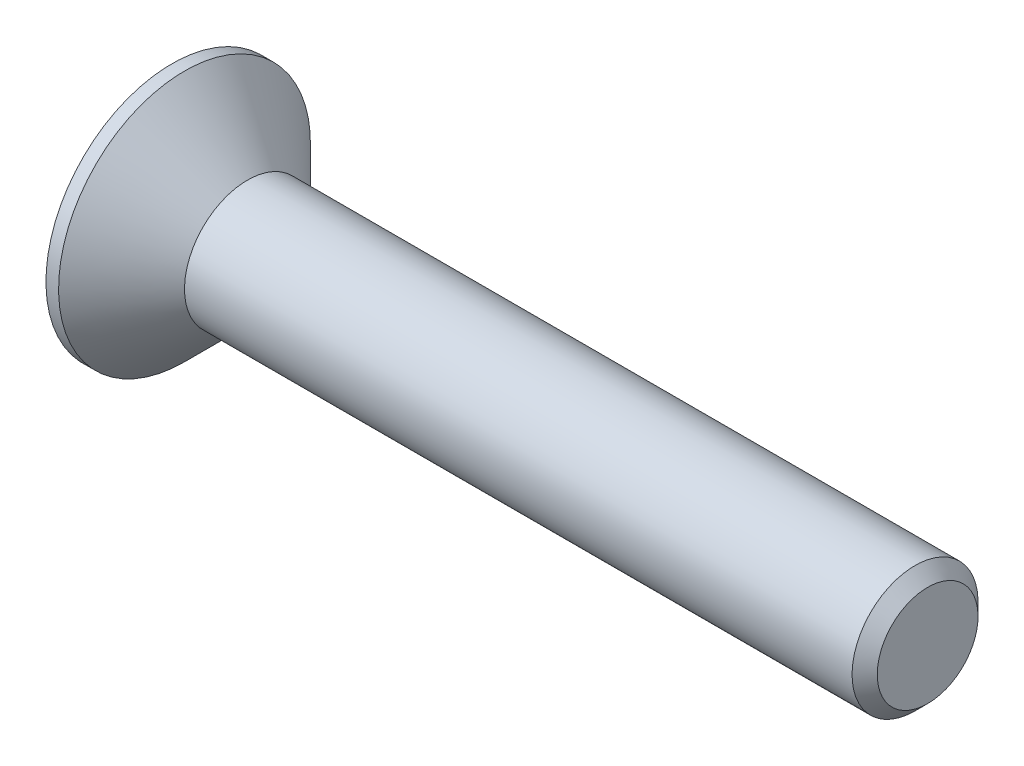
ISO-10303-21;
HEADER;
FILE_DESCRIPTION(('STEP AP214'),'2;1');
FILE_NAME('part.step','',(''),(''),'','','');
FILE_SCHEMA(('AUTOMOTIVE_DESIGN { 1 0 10303 214 1 1 1 1 }'));
ENDSEC;
DATA;
#1=APPLICATION_CONTEXT('core data for automotive mechanical design processes');
#2=APPLICATION_PROTOCOL_DEFINITION('international standard','automotive_design',2000,#1);
#3=PRODUCT_CONTEXT('',#1,'mechanical');
#4=PRODUCT('Part','Part','',(#3));
#5=PRODUCT_RELATED_PRODUCT_CATEGORY('part','',(#4));
#6=PRODUCT_DEFINITION_FORMATION('','',#4);
#7=PRODUCT_DEFINITION_CONTEXT('part definition',#1,'design');
#8=PRODUCT_DEFINITION('design','',#6,#7);
#9=PRODUCT_DEFINITION_SHAPE('','',#8);
#10=(LENGTH_UNIT() NAMED_UNIT(*) SI_UNIT(.MILLI.,.METRE.));
#11=(NAMED_UNIT(*) PLANE_ANGLE_UNIT() SI_UNIT($,.RADIAN.));
#12=(NAMED_UNIT(*) SI_UNIT($,.STERADIAN.) SOLID_ANGLE_UNIT());
#13=UNCERTAINTY_MEASURE_WITH_UNIT(LENGTH_MEASURE(1.E-05),#10,'distance_accuracy_value','');
#14=(GEOMETRIC_REPRESENTATION_CONTEXT(3) GLOBAL_UNCERTAINTY_ASSIGNED_CONTEXT((#13)) GLOBAL_UNIT_ASSIGNED_CONTEXT((#10,
#11,#12)) REPRESENTATION_CONTEXT('',''));
#15=CARTESIAN_POINT('',(0.,0.,0.));
#16=DIRECTION('',(0.,0.,1.));
#17=DIRECTION('',(1.,0.,0.));
#18=AXIS2_PLACEMENT_3D('',#15,#16,#17);
#19=CARTESIAN_POINT('',(-1.2,0.,0.));
#20=DIRECTION('',(-1.,0.,0.));
#21=DIRECTION('',(0.,-1.,0.));
#22=AXIS2_PLACEMENT_3D('',#19,#20,#21);
#23=CYLINDRICAL_SURFACE('',#22,1.);
#24=CARTESIAN_POINT('',(10.6,0.,0.));
#25=DIRECTION('',(-1.,0.,0.));
#26=DIRECTION('',(0.,-1.,0.));
#27=AXIS2_PLACEMENT_3D('',#24,#25,#26);
#28=CIRCLE('',#27,1.);
#29=CARTESIAN_POINT('',(10.6,-1.,0.));
#30=VERTEX_POINT('',#29);
#31=EDGE_CURVE('E41',#30,#30,#28,.T.);
#32=ORIENTED_EDGE('',*,*,#31,.T.);
#33=EDGE_LOOP('',(#32));
#34=FACE_BOUND('',#33,.T.);
#35=CARTESIAN_POINT('',(0.,0.,0.));
#36=DIRECTION('',(-1.,0.,0.));
#37=DIRECTION('',(0.,-1.,0.));
#38=AXIS2_PLACEMENT_3D('',#35,#36,#37);
#39=CIRCLE('',#38,1.);
#40=CARTESIAN_POINT('',(0.,-1.,0.));
#41=VERTEX_POINT('',#40);
#42=EDGE_CURVE('E146',#41,#41,#39,.T.);
#43=ORIENTED_EDGE('',*,*,#42,.F.);
#44=EDGE_LOOP('',(#43));
#45=FACE_BOUND('',#44,.T.);
#46=ADVANCED_FACE('F33',(#34,#45),#23,.T.);
#47=CARTESIAN_POINT('',(0.,0.,0.));
#48=DIRECTION('',(-1.,0.,0.));
#49=DIRECTION('',(0.,-1.,0.));
#50=AXIS2_PLACEMENT_3D('',#47,#48,#49);
#51=CONICAL_SURFACE('',#50,1.,0.785398163397444);
#52=CARTESIAN_POINT('',(-1.00000000000001,0.,0.));
#53=DIRECTION('',(-1.,0.,0.));
#54=DIRECTION('',(0.,-1.,0.));
#55=AXIS2_PLACEMENT_3D('',#52,#53,#54);
#56=CIRCLE('',#55,2.);
#57=CARTESIAN_POINT('',(-1.00000000000001,-2.,0.));
#58=VERTEX_POINT('',#57);
#59=EDGE_CURVE('E143',#58,#58,#56,.T.);
#60=ORIENTED_EDGE('',*,*,#59,.F.);
#61=EDGE_LOOP('',(#60));
#62=FACE_BOUND('',#61,.T.);
#63=ORIENTED_EDGE('',*,*,#42,.T.);
#64=EDGE_LOOP('',(#63));
#65=FACE_BOUND('',#64,.T.);
#66=ADVANCED_FACE('F168',(#62,#65),#51,.T.);
#67=CARTESIAN_POINT('',(-1.2,0.,0.));
#68=DIRECTION('',(-1.,0.,0.));
#69=DIRECTION('',(0.,-1.,0.));
#70=AXIS2_PLACEMENT_3D('',#67,#68,#69);
#71=CYLINDRICAL_SURFACE('',#70,2.);
#72=CARTESIAN_POINT('',(-1.2,0.,0.));
#73=DIRECTION('',(-1.,0.,0.));
#74=DIRECTION('',(0.,-1.,0.));
#75=AXIS2_PLACEMENT_3D('',#72,#73,#74);
#76=CIRCLE('',#75,2.);
#77=CARTESIAN_POINT('',(-1.2,-2.,0.));
#78=VERTEX_POINT('',#77);
#79=EDGE_CURVE('E135',#78,#78,#76,.T.);
#80=ORIENTED_EDGE('',*,*,#79,.F.);
#81=EDGE_LOOP('',(#80));
#82=FACE_BOUND('',#81,.T.);
#83=ORIENTED_EDGE('',*,*,#59,.T.);
#84=EDGE_LOOP('',(#83));
#85=FACE_BOUND('',#84,.T.);
#86=ADVANCED_FACE('F172',(#82,#85),#71,.T.);
#87=CARTESIAN_POINT('',(-1.2,2.,0.));
#88=DIRECTION('',(1.,0.,0.));
#89=DIRECTION('',(0.,1.,0.));
#90=AXIS2_PLACEMENT_3D('',#87,#88,#89);
#91=PLANE('',#90);
#92=DIRECTION('',(0.,-0.866025403784439,0.5));
#93=VECTOR('',#92,1.);
#94=CARTESIAN_POINT('',(-1.2,0.,-0.750555349946514));
#95=LINE('',#94,#93);
#96=CARTESIAN_POINT('',(-1.2,0.,-0.750555349946513));
#97=VERTEX_POINT('',#96);
#98=CARTESIAN_POINT('',(-1.2,-0.65,-0.375277674973257));
#99=VERTEX_POINT('',#98);
#100=EDGE_CURVE('E122',#97,#99,#95,.T.);
#101=ORIENTED_EDGE('',*,*,#100,.F.);
#102=DIRECTION('',(0.,-0.866025403784438,-0.5));
#103=VECTOR('',#102,1.);
#104=CARTESIAN_POINT('',(-1.2,0.65,-0.375277674973257));
#105=LINE('',#104,#103);
#106=CARTESIAN_POINT('',(-1.2,0.65,-0.375277674973257));
#107=VERTEX_POINT('',#106);
#108=EDGE_CURVE('E48',#107,#97,#105,.T.);
#109=ORIENTED_EDGE('',*,*,#108,.F.);
#110=DIRECTION('',(0.,0.,-1.));
#111=VECTOR('',#110,1.);
#112=CARTESIAN_POINT('',(-1.2,0.65,0.375277674973257));
#113=LINE('',#112,#111);
#114=CARTESIAN_POINT('',(-1.2,0.65,0.375277674973257));
#115=VERTEX_POINT('',#114);
#116=EDGE_CURVE('E131',#115,#107,#113,.T.);
#117=ORIENTED_EDGE('',*,*,#116,.F.);
#118=DIRECTION('',(0.,0.866025403784439,-0.5));
#119=VECTOR('',#118,1.);
#120=CARTESIAN_POINT('',(-1.2,0.,0.750555349946513));
#121=LINE('',#120,#119);
#122=CARTESIAN_POINT('',(-1.2,0.,0.750555349946513));
#123=VERTEX_POINT('',#122);
#124=EDGE_CURVE('E129',#123,#115,#121,.T.);
#125=ORIENTED_EDGE('',*,*,#124,.F.);
#126=DIRECTION('',(0.,0.866025403784439,0.5));
#127=VECTOR('',#126,1.);
#128=CARTESIAN_POINT('',(-1.2,-0.65,0.375277674973257));
#129=LINE('',#128,#127);
#130=CARTESIAN_POINT('',(-1.2,-0.65,0.375277674973257));
#131=VERTEX_POINT('',#130);
#132=EDGE_CURVE('E96',#131,#123,#129,.T.);
#133=ORIENTED_EDGE('',*,*,#132,.F.);
#134=DIRECTION('',(0.,0.,1.));
#135=VECTOR('',#134,1.);
#136=CARTESIAN_POINT('',(-1.2,-0.65,-0.375277674973257));
#137=LINE('',#136,#135);
#138=EDGE_CURVE('E125',#99,#131,#137,.T.);
#139=ORIENTED_EDGE('',*,*,#138,.F.);
#140=EDGE_LOOP('',(#101,#109,#117,#125,#133,#139));
#141=FACE_BOUND('',#140,.T.);
#142=ORIENTED_EDGE('',*,*,#79,.T.);
#143=EDGE_LOOP('',(#142));
#144=FACE_BOUND('',#143,.T.);
#145=ADVANCED_FACE('F163',(#141,#144),#91,.F.);
#146=CARTESIAN_POINT('',(10.8,0.,0.));
#147=DIRECTION('',(-1.,0.,0.));
#148=DIRECTION('',(0.,-1.,0.));
#149=AXIS2_PLACEMENT_3D('',#146,#147,#148);
#150=PLANE('',#149);
#151=CARTESIAN_POINT('',(10.8,0.,0.));
#152=DIRECTION('',(-1.,0.,0.));
#153=DIRECTION('',(0.,-1.,0.));
#154=AXIS2_PLACEMENT_3D('',#151,#152,#153);
#155=CIRCLE('',#154,0.800000000000004);
#156=CARTESIAN_POINT('',(10.8,-0.800000000000004,0.));
#157=VERTEX_POINT('',#156);
#158=EDGE_CURVE('E11',#157,#157,#155,.F.);
#159=ORIENTED_EDGE('',*,*,#158,.T.);
#160=EDGE_LOOP('',(#159));
#161=FACE_BOUND('',#160,.T.);
#162=ADVANCED_FACE('F155',(#161),#150,.F.);
#163=CARTESIAN_POINT('',(10.6,0.,0.));
#164=DIRECTION('',(-1.,0.,0.));
#165=DIRECTION('',(0.,-1.,0.));
#166=AXIS2_PLACEMENT_3D('',#163,#164,#165);
#167=CONICAL_SURFACE('',#166,1.,0.785398163397442);
#168=ORIENTED_EDGE('',*,*,#158,.F.);
#169=EDGE_LOOP('',(#168));
#170=FACE_BOUND('',#169,.T.);
#171=ORIENTED_EDGE('',*,*,#31,.F.);
#172=EDGE_LOOP('',(#171));
#173=FACE_BOUND('',#172,.T.);
#174=ADVANCED_FACE('F35',(#170,#173),#167,.T.);
#175=CARTESIAN_POINT('',(-0.45,0.65,-0.375277674973257));
#176=DIRECTION('',(0.,0.5,-0.866025403784439));
#177=DIRECTION('',(0.,0.866025403784439,0.5));
#178=AXIS2_PLACEMENT_3D('',#175,#176,#177);
#179=PLANE('',#178);
#180=ORIENTED_EDGE('',*,*,#108,.T.);
#181=DIRECTION('',(-1.,0.,0.));
#182=VECTOR('',#181,1.);
#183=CARTESIAN_POINT('',(-0.45,0.,-0.750555349946514));
#184=LINE('',#183,#182);
#185=CARTESIAN_POINT('',(-0.45,0.,-0.750555349946514));
#186=VERTEX_POINT('',#185);
#187=EDGE_CURVE('E78',#186,#97,#184,.T.);
#188=ORIENTED_EDGE('',*,*,#187,.F.);
#189=DIRECTION('',(0.,-0.866025403784438,-0.5));
#190=VECTOR('',#189,1.);
#191=CARTESIAN_POINT('',(-0.45,0.65,-0.375277674973257));
#192=LINE('',#191,#190);
#193=CARTESIAN_POINT('',(-0.45,0.65,-0.375277674973257));
#194=VERTEX_POINT('',#193);
#195=EDGE_CURVE('E133',#194,#186,#192,.T.);
#196=ORIENTED_EDGE('',*,*,#195,.F.);
#197=DIRECTION('',(-1.,0.,0.));
#198=VECTOR('',#197,1.);
#199=CARTESIAN_POINT('',(-0.45,0.65,-0.375277674973257));
#200=LINE('',#199,#198);
#201=EDGE_CURVE('E56',#194,#107,#200,.T.);
#202=ORIENTED_EDGE('',*,*,#201,.T.);
#203=EDGE_LOOP('',(#180,#188,#196,#202));
#204=FACE_BOUND('',#203,.T.);
#205=ADVANCED_FACE('F154',(#204),#179,.F.);
#206=CARTESIAN_POINT('',(-0.45,0.65,0.375277674973257));
#207=DIRECTION('',(0.,1.,0.));
#208=DIRECTION('',(0.,0.,1.));
#209=AXIS2_PLACEMENT_3D('',#206,#207,#208);
#210=PLANE('',#209);
#211=ORIENTED_EDGE('',*,*,#116,.T.);
#212=ORIENTED_EDGE('',*,*,#201,.F.);
#213=DIRECTION('',(0.,0.,-1.));
#214=VECTOR('',#213,1.);
#215=CARTESIAN_POINT('',(-0.45,0.65,0.375277674973257));
#216=LINE('',#215,#214);
#217=CARTESIAN_POINT('',(-0.45,0.65,0.375277674973257));
#218=VERTEX_POINT('',#217);
#219=EDGE_CURVE('E108',#218,#194,#216,.T.);
#220=ORIENTED_EDGE('',*,*,#219,.F.);
#221=DIRECTION('',(-1.,0.,0.));
#222=VECTOR('',#221,1.);
#223=CARTESIAN_POINT('',(-0.45,0.65,0.375277674973257));
#224=LINE('',#223,#222);
#225=EDGE_CURVE('E100',#218,#115,#224,.T.);
#226=ORIENTED_EDGE('',*,*,#225,.T.);
#227=EDGE_LOOP('',(#211,#212,#220,#226));
#228=FACE_BOUND('',#227,.T.);
#229=ADVANCED_FACE('F161',(#228),#210,.F.);
#230=CARTESIAN_POINT('',(-0.45,0.,0.750555349946513));
#231=DIRECTION('',(0.,0.5,0.866025403784439));
#232=DIRECTION('',(0.,-0.866025403784439,0.5));
#233=AXIS2_PLACEMENT_3D('',#230,#231,#232);
#234=PLANE('',#233);
#235=ORIENTED_EDGE('',*,*,#124,.T.);
#236=ORIENTED_EDGE('',*,*,#225,.F.);
#237=DIRECTION('',(0.,0.866025403784439,-0.5));
#238=VECTOR('',#237,1.);
#239=CARTESIAN_POINT('',(-0.45,0.,0.750555349946513));
#240=LINE('',#239,#238);
#241=CARTESIAN_POINT('',(-0.45,0.,0.750555349946513));
#242=VERTEX_POINT('',#241);
#243=EDGE_CURVE('E104',#242,#218,#240,.T.);
#244=ORIENTED_EDGE('',*,*,#243,.F.);
#245=DIRECTION('',(-1.,0.,0.));
#246=VECTOR('',#245,1.);
#247=CARTESIAN_POINT('',(-0.45,0.,0.750555349946513));
#248=LINE('',#247,#246);
#249=EDGE_CURVE('E89',#242,#123,#248,.T.);
#250=ORIENTED_EDGE('',*,*,#249,.T.);
#251=EDGE_LOOP('',(#235,#236,#244,#250));
#252=FACE_BOUND('',#251,.T.);
#253=ADVANCED_FACE('F105',(#252),#234,.F.);
#254=CARTESIAN_POINT('',(-0.45,-0.65,0.375277674973257));
#255=DIRECTION('',(0.,-0.5,0.866025403784439));
#256=DIRECTION('',(0.,-0.866025403784439,-0.5));
#257=AXIS2_PLACEMENT_3D('',#254,#255,#256);
#258=PLANE('',#257);
#259=ORIENTED_EDGE('',*,*,#132,.T.);
#260=ORIENTED_EDGE('',*,*,#249,.F.);
#261=DIRECTION('',(0.,0.866025403784439,0.5));
#262=VECTOR('',#261,1.);
#263=CARTESIAN_POINT('',(-0.45,-0.65,0.375277674973257));
#264=LINE('',#263,#262);
#265=CARTESIAN_POINT('',(-0.45,-0.65,0.375277674973257));
#266=VERTEX_POINT('',#265);
#267=EDGE_CURVE('E93',#266,#242,#264,.T.);
#268=ORIENTED_EDGE('',*,*,#267,.F.);
#269=DIRECTION('',(-1.,0.,0.));
#270=VECTOR('',#269,1.);
#271=CARTESIAN_POINT('',(-0.45,-0.65,0.375277674973257));
#272=LINE('',#271,#270);
#273=EDGE_CURVE('E101',#266,#131,#272,.T.);
#274=ORIENTED_EDGE('',*,*,#273,.T.);
#275=EDGE_LOOP('',(#259,#260,#268,#274));
#276=FACE_BOUND('',#275,.T.);
#277=ADVANCED_FACE('F91',(#276),#258,.F.);
#278=CARTESIAN_POINT('',(-0.45,-0.65,-0.375277674973257));
#279=DIRECTION('',(0.,-1.,0.));
#280=DIRECTION('',(0.,0.,-1.));
#281=AXIS2_PLACEMENT_3D('',#278,#279,#280);
#282=PLANE('',#281);
#283=ORIENTED_EDGE('',*,*,#138,.T.);
#284=ORIENTED_EDGE('',*,*,#273,.F.);
#285=DIRECTION('',(0.,0.,1.));
#286=VECTOR('',#285,1.);
#287=CARTESIAN_POINT('',(-0.45,-0.65,-0.375277674973257));
#288=LINE('',#287,#286);
#289=CARTESIAN_POINT('',(-0.45,-0.65,-0.375277674973257));
#290=VERTEX_POINT('',#289);
#291=EDGE_CURVE('E114',#290,#266,#288,.T.);
#292=ORIENTED_EDGE('',*,*,#291,.F.);
#293=DIRECTION('',(-1.,0.,0.));
#294=VECTOR('',#293,1.);
#295=CARTESIAN_POINT('',(-0.45,-0.65,-0.375277674973257));
#296=LINE('',#295,#294);
#297=EDGE_CURVE('E138',#290,#99,#296,.T.);
#298=ORIENTED_EDGE('',*,*,#297,.T.);
#299=EDGE_LOOP('',(#283,#284,#292,#298));
#300=FACE_BOUND('',#299,.T.);
#301=ADVANCED_FACE('F185',(#300),#282,.F.);
#302=CARTESIAN_POINT('',(-0.45,0.,-0.750555349946514));
#303=DIRECTION('',(0.,-0.5,-0.866025403784439));
#304=DIRECTION('',(0.,0.866025403784439,-0.5));
#305=AXIS2_PLACEMENT_3D('',#302,#303,#304);
#306=PLANE('',#305);
#307=ORIENTED_EDGE('',*,*,#100,.T.);
#308=ORIENTED_EDGE('',*,*,#297,.F.);
#309=DIRECTION('',(0.,-0.866025403784439,0.5));
#310=VECTOR('',#309,1.);
#311=CARTESIAN_POINT('',(-0.45,0.,-0.750555349946514));
#312=LINE('',#311,#310);
#313=EDGE_CURVE('E116',#186,#290,#312,.T.);
#314=ORIENTED_EDGE('',*,*,#313,.F.);
#315=ORIENTED_EDGE('',*,*,#187,.T.);
#316=EDGE_LOOP('',(#307,#308,#314,#315));
#317=FACE_BOUND('',#316,.T.);
#318=ADVANCED_FACE('F182',(#317),#306,.F.);
#319=CARTESIAN_POINT('',(-0.45,0.,0.));
#320=DIRECTION('',(-1.,0.,0.));
#321=DIRECTION('',(0.,0.,1.));
#322=AXIS2_PLACEMENT_3D('',#319,#320,#321);
#323=PLANE('',#322);
#324=ORIENTED_EDGE('',*,*,#195,.T.);
#325=ORIENTED_EDGE('',*,*,#313,.T.);
#326=ORIENTED_EDGE('',*,*,#291,.T.);
#327=ORIENTED_EDGE('',*,*,#267,.T.);
#328=ORIENTED_EDGE('',*,*,#243,.T.);
#329=ORIENTED_EDGE('',*,*,#219,.T.);
#330=EDGE_LOOP('',(#324,#325,#326,#327,#328,#329));
#331=FACE_BOUND('',#330,.T.);
#332=ADVANCED_FACE('F111',(#331),#323,.T.);
#333=CLOSED_SHELL('',(#46,#66,#86,#145,#162,#174,#205,#229,#253,#277,#301,#318,#332));
#334=MANIFOLD_SOLID_BREP('B2',#333);
#335=ADVANCED_BREP_SHAPE_REPRESENTATION('',(#18,#334),#14);
#336=SHAPE_DEFINITION_REPRESENTATION(#9,#335);
ENDSEC;
END-ISO-10303-21;
